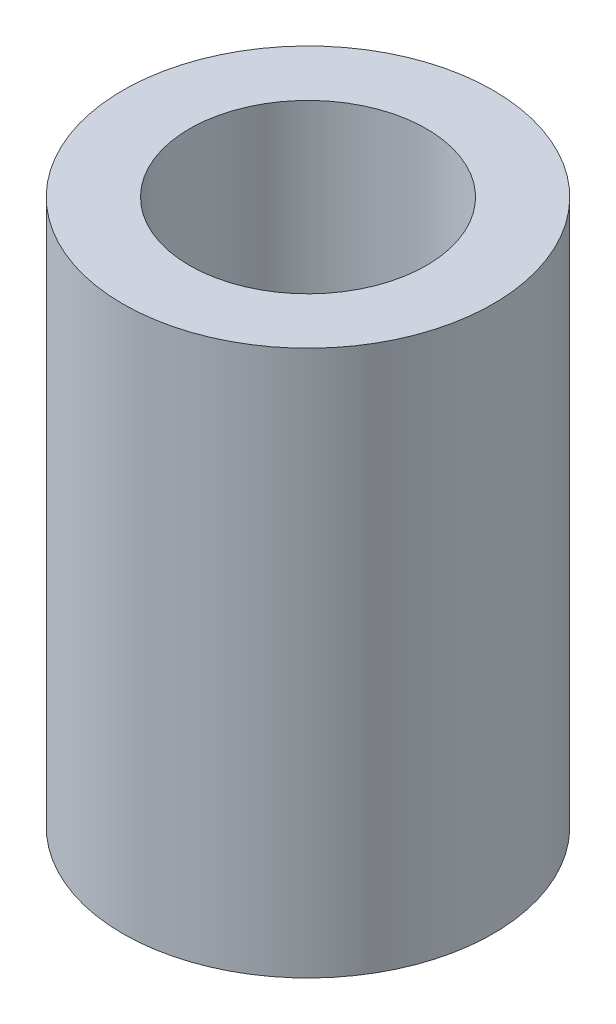
ISO-10303-21;
HEADER;
FILE_DESCRIPTION(('STEP AP214'),'2;1');
FILE_NAME('part.step','',(''),(''),'','','');
FILE_SCHEMA(('AUTOMOTIVE_DESIGN { 1 0 10303 214 1 1 1 1 }'));
ENDSEC;
DATA;
#1=APPLICATION_CONTEXT('core data for automotive mechanical design processes');
#2=APPLICATION_PROTOCOL_DEFINITION('international standard','automotive_design',2000,#1);
#3=PRODUCT_CONTEXT('',#1,'mechanical');
#4=PRODUCT('Part','Part','',(#3));
#5=PRODUCT_RELATED_PRODUCT_CATEGORY('part','',(#4));
#6=PRODUCT_DEFINITION_FORMATION('','',#4);
#7=PRODUCT_DEFINITION_CONTEXT('part definition',#1,'design');
#8=PRODUCT_DEFINITION('design','',#6,#7);
#9=PRODUCT_DEFINITION_SHAPE('','',#8);
#10=(LENGTH_UNIT() NAMED_UNIT(*) SI_UNIT(.MILLI.,.METRE.));
#11=(NAMED_UNIT(*) PLANE_ANGLE_UNIT() SI_UNIT($,.RADIAN.));
#12=(NAMED_UNIT(*) SI_UNIT($,.STERADIAN.) SOLID_ANGLE_UNIT());
#13=UNCERTAINTY_MEASURE_WITH_UNIT(LENGTH_MEASURE(1.E-05),#10,'distance_accuracy_value','');
#14=(GEOMETRIC_REPRESENTATION_CONTEXT(3) GLOBAL_UNCERTAINTY_ASSIGNED_CONTEXT((#13)) GLOBAL_UNIT_ASSIGNED_CONTEXT((#10,
#11,#12)) REPRESENTATION_CONTEXT('',''));
#15=CARTESIAN_POINT('',(0.,0.,0.));
#16=DIRECTION('',(0.,0.,1.));
#17=DIRECTION('',(1.,0.,0.));
#18=AXIS2_PLACEMENT_3D('',#15,#16,#17);
#19=CARTESIAN_POINT('',(0.,7.366,0.));
#20=DIRECTION('',(0.,1.,0.));
#21=DIRECTION('',(0.,0.,1.));
#22=AXIS2_PLACEMENT_3D('',#19,#20,#21);
#23=PLANE('',#22);
#24=CARTESIAN_POINT('',(0.,7.366,0.));
#25=DIRECTION('',(0.,1.,0.));
#26=DIRECTION('',(0.,0.,1.));
#27=AXIS2_PLACEMENT_3D('',#24,#25,#26);
#28=CIRCLE('',#27,2.5);
#29=CARTESIAN_POINT('',(0.,7.366,2.5));
#30=VERTEX_POINT('',#29);
#31=EDGE_CURVE('E10',#30,#30,#28,.T.);
#32=ORIENTED_EDGE('',*,*,#31,.T.);
#33=EDGE_LOOP('',(#32));
#34=FACE_BOUND('',#33,.T.);
#35=CARTESIAN_POINT('',(0.,7.366,0.));
#36=DIRECTION('',(0.,1.,0.));
#37=DIRECTION('',(0.,0.,1.));
#38=AXIS2_PLACEMENT_3D('',#35,#36,#37);
#39=CIRCLE('',#38,1.6);
#40=CARTESIAN_POINT('',(0.,7.366,1.6));
#41=VERTEX_POINT('',#40);
#42=EDGE_CURVE('E42',#41,#41,#39,.T.);
#43=ORIENTED_EDGE('',*,*,#42,.F.);
#44=EDGE_LOOP('',(#43));
#45=FACE_BOUND('',#44,.T.);
#46=ADVANCED_FACE('F31',(#34,#45),#23,.T.);
#47=CARTESIAN_POINT('',(0.,0.,0.));
#48=DIRECTION('',(0.,1.,0.));
#49=DIRECTION('',(0.,0.,1.));
#50=AXIS2_PLACEMENT_3D('',#47,#48,#49);
#51=PLANE('',#50);
#52=CARTESIAN_POINT('',(0.,0.,0.));
#53=DIRECTION('',(0.,1.,0.));
#54=DIRECTION('',(0.,0.,1.));
#55=AXIS2_PLACEMENT_3D('',#52,#53,#54);
#56=CIRCLE('',#55,2.5);
#57=CARTESIAN_POINT('',(0.,0.,2.5));
#58=VERTEX_POINT('',#57);
#59=EDGE_CURVE('E35',#58,#58,#56,.T.);
#60=ORIENTED_EDGE('',*,*,#59,.F.);
#61=EDGE_LOOP('',(#60));
#62=FACE_BOUND('',#61,.T.);
#63=CARTESIAN_POINT('',(0.,0.,0.));
#64=DIRECTION('',(0.,1.,0.));
#65=DIRECTION('',(0.,0.,1.));
#66=AXIS2_PLACEMENT_3D('',#63,#64,#65);
#67=CIRCLE('',#66,1.6);
#68=CARTESIAN_POINT('',(0.,0.,1.6));
#69=VERTEX_POINT('',#68);
#70=EDGE_CURVE('E44',#69,#69,#67,.T.);
#71=ORIENTED_EDGE('',*,*,#70,.T.);
#72=EDGE_LOOP('',(#71));
#73=FACE_BOUND('',#72,.T.);
#74=ADVANCED_FACE('F54',(#62,#73),#51,.F.);
#75=CARTESIAN_POINT('',(0.,7.366,0.));
#76=DIRECTION('',(0.,-1.,0.));
#77=DIRECTION('',(0.,0.,-1.));
#78=AXIS2_PLACEMENT_3D('',#75,#76,#77);
#79=CYLINDRICAL_SURFACE('',#78,2.5);
#80=ORIENTED_EDGE('',*,*,#31,.F.);
#81=EDGE_LOOP('',(#80));
#82=FACE_BOUND('',#81,.T.);
#83=ORIENTED_EDGE('',*,*,#59,.T.);
#84=EDGE_LOOP('',(#83));
#85=FACE_BOUND('',#84,.T.);
#86=ADVANCED_FACE('F33',(#82,#85),#79,.T.);
#87=CARTESIAN_POINT('',(0.,7.366,0.));
#88=DIRECTION('',(0.,-1.,0.));
#89=DIRECTION('',(0.,0.,-1.));
#90=AXIS2_PLACEMENT_3D('',#87,#88,#89);
#91=CYLINDRICAL_SURFACE('',#90,1.6);
#92=ORIENTED_EDGE('',*,*,#42,.T.);
#93=EDGE_LOOP('',(#92));
#94=FACE_BOUND('',#93,.T.);
#95=ORIENTED_EDGE('',*,*,#70,.F.);
#96=EDGE_LOOP('',(#95));
#97=FACE_BOUND('',#96,.T.);
#98=ADVANCED_FACE('F50',(#94,#97),#91,.F.);
#99=CLOSED_SHELL('',(#46,#74,#86,#98));
#100=MANIFOLD_SOLID_BREP('B2',#99);
#101=ADVANCED_BREP_SHAPE_REPRESENTATION('',(#18,#100),#14);
#102=SHAPE_DEFINITION_REPRESENTATION(#9,#101);
ENDSEC;
END-ISO-10303-21;
